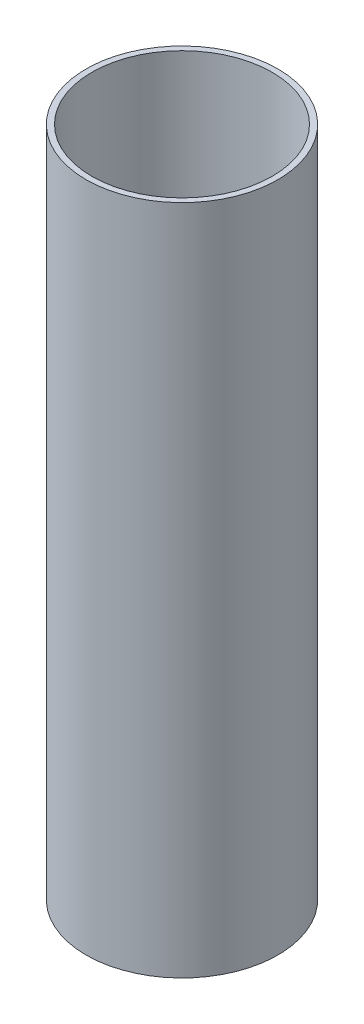
ISO-10303-21;
HEADER;
FILE_DESCRIPTION(('STEP AP214'),'2;1');
FILE_NAME('part.step','',(''),(''),'','','');
FILE_SCHEMA(('AUTOMOTIVE_DESIGN { 1 0 10303 214 1 1 1 1 }'));
ENDSEC;
DATA;
#1=APPLICATION_CONTEXT('core data for automotive mechanical design processes');
#2=APPLICATION_PROTOCOL_DEFINITION('international standard','automotive_design',2000,#1);
#3=PRODUCT_CONTEXT('',#1,'mechanical');
#4=PRODUCT('Part','Part','',(#3));
#5=PRODUCT_RELATED_PRODUCT_CATEGORY('part','',(#4));
#6=PRODUCT_DEFINITION_FORMATION('','',#4);
#7=PRODUCT_DEFINITION_CONTEXT('part definition',#1,'design');
#8=PRODUCT_DEFINITION('design','',#6,#7);
#9=PRODUCT_DEFINITION_SHAPE('','',#8);
#10=(LENGTH_UNIT() NAMED_UNIT(*) SI_UNIT(.MILLI.,.METRE.));
#11=(NAMED_UNIT(*) PLANE_ANGLE_UNIT() SI_UNIT($,.RADIAN.));
#12=(NAMED_UNIT(*) SI_UNIT($,.STERADIAN.) SOLID_ANGLE_UNIT());
#13=UNCERTAINTY_MEASURE_WITH_UNIT(LENGTH_MEASURE(1.E-05),#10,'distance_accuracy_value','');
#14=(GEOMETRIC_REPRESENTATION_CONTEXT(3) GLOBAL_UNCERTAINTY_ASSIGNED_CONTEXT((#13)) GLOBAL_UNIT_ASSIGNED_CONTEXT((#10,
#11,#12)) REPRESENTATION_CONTEXT('',''));
#15=CARTESIAN_POINT('',(0.,0.,0.));
#16=DIRECTION('',(0.,0.,1.));
#17=DIRECTION('',(1.,0.,0.));
#18=AXIS2_PLACEMENT_3D('',#15,#16,#17);
#19=CARTESIAN_POINT('',(0.,44.45,0.));
#20=DIRECTION('',(0.,1.,0.));
#21=DIRECTION('',(0.,0.,1.));
#22=AXIS2_PLACEMENT_3D('',#19,#20,#21);
#23=PLANE('',#22);
#24=CARTESIAN_POINT('',(0.,44.45,0.));
#25=DIRECTION('',(0.,1.,0.));
#26=DIRECTION('',(0.,0.,1.));
#27=AXIS2_PLACEMENT_3D('',#24,#25,#26);
#28=CIRCLE('',#27,6.35);
#29=CARTESIAN_POINT('',(0.,44.45,6.35));
#30=VERTEX_POINT('',#29);
#31=EDGE_CURVE('E10',#30,#30,#28,.T.);
#32=ORIENTED_EDGE('',*,*,#31,.T.);
#33=EDGE_LOOP('',(#32));
#34=FACE_BOUND('',#33,.T.);
#35=CARTESIAN_POINT('',(0.,44.45,0.));
#36=DIRECTION('',(0.,1.,0.));
#37=DIRECTION('',(0.,0.,1.));
#38=AXIS2_PLACEMENT_3D('',#35,#36,#37);
#39=CIRCLE('',#38,5.969);
#40=CARTESIAN_POINT('',(0.,44.45,5.969));
#41=VERTEX_POINT('',#40);
#42=EDGE_CURVE('E50',#41,#41,#39,.T.);
#43=ORIENTED_EDGE('',*,*,#42,.F.);
#44=EDGE_LOOP('',(#43));
#45=FACE_BOUND('',#44,.T.);
#46=ADVANCED_FACE('F37',(#34,#45),#23,.T.);
#47=CARTESIAN_POINT('',(0.,0.,0.));
#48=DIRECTION('',(0.,1.,0.));
#49=DIRECTION('',(0.,0.,1.));
#50=AXIS2_PLACEMENT_3D('',#47,#48,#49);
#51=PLANE('',#50);
#52=CARTESIAN_POINT('',(0.,0.,0.));
#53=DIRECTION('',(0.,1.,0.));
#54=DIRECTION('',(0.,0.,1.));
#55=AXIS2_PLACEMENT_3D('',#52,#53,#54);
#56=CIRCLE('',#55,6.35);
#57=CARTESIAN_POINT('',(0.,0.,6.35));
#58=VERTEX_POINT('',#57);
#59=EDGE_CURVE('E41',#58,#58,#56,.T.);
#60=ORIENTED_EDGE('',*,*,#59,.F.);
#61=EDGE_LOOP('',(#60));
#62=FACE_BOUND('',#61,.T.);
#63=CARTESIAN_POINT('',(0.,0.,0.));
#64=DIRECTION('',(0.,1.,0.));
#65=DIRECTION('',(0.,0.,1.));
#66=AXIS2_PLACEMENT_3D('',#63,#64,#65);
#67=CIRCLE('',#66,5.969);
#68=CARTESIAN_POINT('',(0.,0.,5.969));
#69=VERTEX_POINT('',#68);
#70=EDGE_CURVE('E52',#69,#69,#67,.T.);
#71=ORIENTED_EDGE('',*,*,#70,.T.);
#72=EDGE_LOOP('',(#71));
#73=FACE_BOUND('',#72,.T.);
#74=ADVANCED_FACE('F64',(#62,#73),#51,.F.);
#75=CARTESIAN_POINT('',(0.,44.45,0.));
#76=DIRECTION('',(0.,-1.,0.));
#77=DIRECTION('',(0.,0.,-1.));
#78=AXIS2_PLACEMENT_3D('',#75,#76,#77);
#79=CYLINDRICAL_SURFACE('',#78,6.35);
#80=ORIENTED_EDGE('',*,*,#31,.F.);
#81=EDGE_LOOP('',(#80));
#82=FACE_BOUND('',#81,.T.);
#83=ORIENTED_EDGE('',*,*,#59,.T.);
#84=EDGE_LOOP('',(#83));
#85=FACE_BOUND('',#84,.T.);
#86=ADVANCED_FACE('F39',(#82,#85),#79,.T.);
#87=CARTESIAN_POINT('',(0.,44.45,0.));
#88=DIRECTION('',(0.,-1.,0.));
#89=DIRECTION('',(0.,0.,-1.));
#90=AXIS2_PLACEMENT_3D('',#87,#88,#89);
#91=CYLINDRICAL_SURFACE('',#90,5.969);
#92=ORIENTED_EDGE('',*,*,#42,.T.);
#93=EDGE_LOOP('',(#92));
#94=FACE_BOUND('',#93,.T.);
#95=ORIENTED_EDGE('',*,*,#70,.F.);
#96=EDGE_LOOP('',(#95));
#97=FACE_BOUND('',#96,.T.);
#98=ADVANCED_FACE('F60',(#94,#97),#91,.F.);
#99=CLOSED_SHELL('',(#46,#74,#86,#98));
#100=MANIFOLD_SOLID_BREP('B2',#99);
#101=ADVANCED_BREP_SHAPE_REPRESENTATION('',(#18,#100),#14);
#102=SHAPE_DEFINITION_REPRESENTATION(#9,#101);
ENDSEC;
END-ISO-10303-21;
